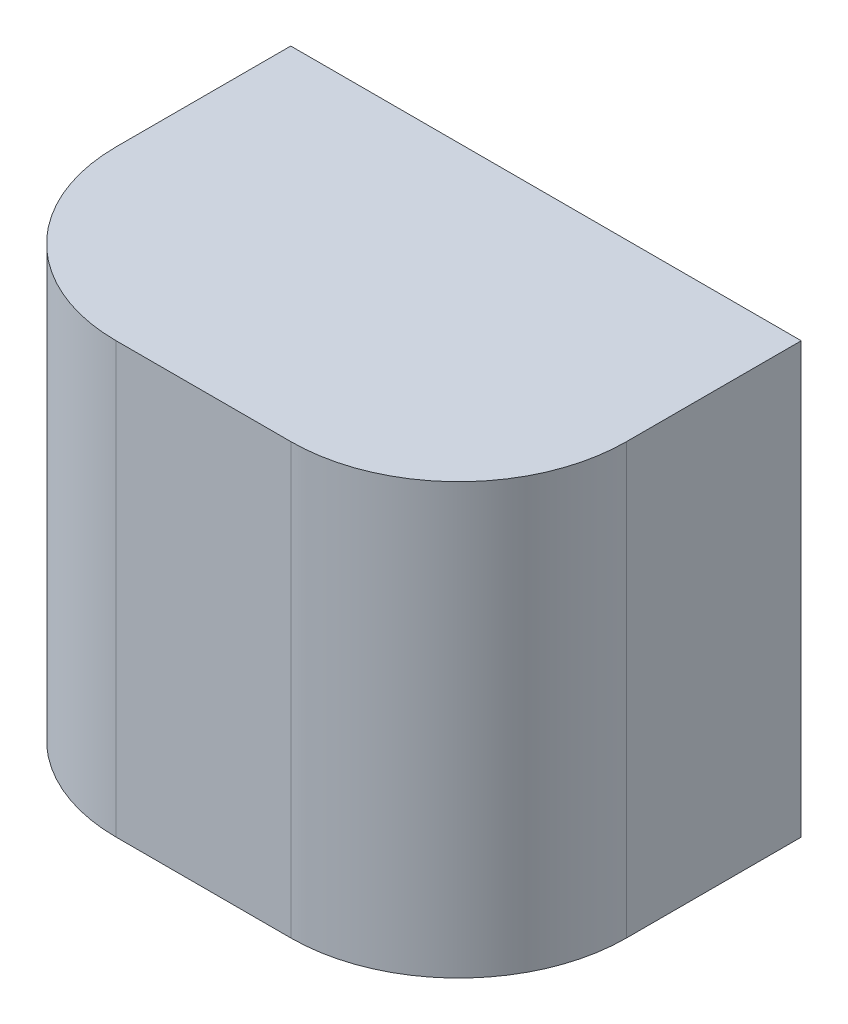
ISO-10303-21;
HEADER;
FILE_DESCRIPTION(('STEP AP214'),'2;1');
FILE_NAME('part.step','',(''),(''),'','','');
FILE_SCHEMA(('AUTOMOTIVE_DESIGN { 1 0 10303 214 1 1 1 1 }'));
ENDSEC;
DATA;
#1=APPLICATION_CONTEXT('core data for automotive mechanical design processes');
#2=APPLICATION_PROTOCOL_DEFINITION('international standard','automotive_design',2000,#1);
#3=PRODUCT_CONTEXT('',#1,'mechanical');
#4=PRODUCT('Part','Part','',(#3));
#5=PRODUCT_RELATED_PRODUCT_CATEGORY('part','',(#4));
#6=PRODUCT_DEFINITION_FORMATION('','',#4);
#7=PRODUCT_DEFINITION_CONTEXT('part definition',#1,'design');
#8=PRODUCT_DEFINITION('design','',#6,#7);
#9=PRODUCT_DEFINITION_SHAPE('','',#8);
#10=(LENGTH_UNIT() NAMED_UNIT(*) SI_UNIT(.MILLI.,.METRE.));
#11=(NAMED_UNIT(*) PLANE_ANGLE_UNIT() SI_UNIT($,.RADIAN.));
#12=(NAMED_UNIT(*) SI_UNIT($,.STERADIAN.) SOLID_ANGLE_UNIT());
#13=UNCERTAINTY_MEASURE_WITH_UNIT(LENGTH_MEASURE(1.E-05),#10,'distance_accuracy_value','');
#14=(GEOMETRIC_REPRESENTATION_CONTEXT(3) GLOBAL_UNCERTAINTY_ASSIGNED_CONTEXT((#13)) GLOBAL_UNIT_ASSIGNED_CONTEXT((#10,
#11,#12)) REPRESENTATION_CONTEXT('',''));
#15=CARTESIAN_POINT('',(0.,0.,0.));
#16=DIRECTION('',(0.,0.,1.));
#17=DIRECTION('',(1.,0.,0.));
#18=AXIS2_PLACEMENT_3D('',#15,#16,#17);
#19=CARTESIAN_POINT('',(1.4,0.,1.655));
#20=DIRECTION('',(0.,-1.,0.));
#21=DIRECTION('',(0.,0.,-1.));
#22=AXIS2_PLACEMENT_3D('',#19,#20,#21);
#23=CYLINDRICAL_SURFACE('',#22,0.25);
#24=CARTESIAN_POINT('',(1.4,-0.64,1.655));
#25=DIRECTION('',(0.,-1.,0.));
#26=DIRECTION('',(0.,0.,-1.));
#27=AXIS2_PLACEMENT_3D('',#24,#25,#26);
#28=CIRCLE('',#27,0.25);
#29=CARTESIAN_POINT('',(1.65,-0.64,1.655));
#30=VERTEX_POINT('',#29);
#31=CARTESIAN_POINT('',(1.4,-0.64,1.905));
#32=VERTEX_POINT('',#31);
#33=EDGE_CURVE('E11',#30,#32,#28,.T.);
#34=ORIENTED_EDGE('',*,*,#33,.F.);
#35=DIRECTION('',(0.,-1.,0.));
#36=VECTOR('',#35,1.);
#37=CARTESIAN_POINT('',(1.65,0.,1.655));
#38=LINE('',#37,#36);
#39=CARTESIAN_POINT('',(1.65,0.,1.655));
#40=VERTEX_POINT('',#39);
#41=EDGE_CURVE('E24',#40,#30,#38,.T.);
#42=ORIENTED_EDGE('',*,*,#41,.F.);
#43=CARTESIAN_POINT('',(1.4,0.,1.655));
#44=DIRECTION('',(0.,-1.,0.));
#45=DIRECTION('',(0.,0.,-1.));
#46=AXIS2_PLACEMENT_3D('',#43,#44,#45);
#47=CIRCLE('',#46,0.25);
#48=CARTESIAN_POINT('',(1.4,0.,1.905));
#49=VERTEX_POINT('',#48);
#50=EDGE_CURVE('E119',#40,#49,#47,.T.);
#51=ORIENTED_EDGE('',*,*,#50,.T.);
#52=DIRECTION('',(0.,-1.,0.));
#53=VECTOR('',#52,1.);
#54=CARTESIAN_POINT('',(1.4,0.,1.905));
#55=LINE('',#54,#53);
#56=EDGE_CURVE('E90',#49,#32,#55,.T.);
#57=ORIENTED_EDGE('',*,*,#56,.T.);
#58=EDGE_LOOP('',(#34,#42,#51,#57));
#59=FACE_BOUND('',#58,.T.);
#60=ADVANCED_FACE('F17',(#59),#23,.T.);
#61=CARTESIAN_POINT('',(1.65,0.,1.395));
#62=DIRECTION('',(1.,0.,0.));
#63=DIRECTION('',(0.,0.,-1.));
#64=AXIS2_PLACEMENT_3D('',#61,#62,#63);
#65=PLANE('',#64);
#66=DIRECTION('',(0.,0.,1.));
#67=VECTOR('',#66,1.);
#68=CARTESIAN_POINT('',(1.65,-0.64,1.395));
#69=LINE('',#68,#67);
#70=CARTESIAN_POINT('',(1.65,-0.64,1.395));
#71=VERTEX_POINT('',#70);
#72=EDGE_CURVE('E116',#71,#30,#69,.T.);
#73=ORIENTED_EDGE('',*,*,#72,.F.);
#74=DIRECTION('',(0.,-1.,0.));
#75=VECTOR('',#74,1.);
#76=CARTESIAN_POINT('',(1.65,0.,1.395));
#77=LINE('',#76,#75);
#78=CARTESIAN_POINT('',(1.65,0.,1.395));
#79=VERTEX_POINT('',#78);
#80=EDGE_CURVE('E113',#79,#71,#77,.T.);
#81=ORIENTED_EDGE('',*,*,#80,.F.);
#82=DIRECTION('',(0.,0.,1.));
#83=VECTOR('',#82,1.);
#84=CARTESIAN_POINT('',(1.65,0.,1.395));
#85=LINE('',#84,#83);
#86=EDGE_CURVE('E110',#79,#40,#85,.T.);
#87=ORIENTED_EDGE('',*,*,#86,.T.);
#88=ORIENTED_EDGE('',*,*,#41,.T.);
#89=EDGE_LOOP('',(#73,#81,#87,#88));
#90=FACE_BOUND('',#89,.T.);
#91=ADVANCED_FACE('F121',(#90),#65,.T.);
#92=CARTESIAN_POINT('',(1.65,0.,1.395));
#93=DIRECTION('',(0.,0.,-1.));
#94=DIRECTION('',(-1.,0.,0.));
#95=AXIS2_PLACEMENT_3D('',#92,#93,#94);
#96=PLANE('',#95);
#97=DIRECTION('',(1.,0.,0.));
#98=VECTOR('',#97,1.);
#99=CARTESIAN_POINT('',(1.65,-0.64,1.395));
#100=LINE('',#99,#98);
#101=CARTESIAN_POINT('',(0.88999999999999,-0.64,1.395));
#102=VERTEX_POINT('',#101);
#103=EDGE_CURVE('E107',#102,#71,#100,.T.);
#104=ORIENTED_EDGE('',*,*,#103,.F.);
#105=DIRECTION('',(0.,-1.,0.));
#106=VECTOR('',#105,1.);
#107=CARTESIAN_POINT('',(0.88999999999999,0.,1.395));
#108=LINE('',#107,#106);
#109=CARTESIAN_POINT('',(0.88999999999999,0.,1.395));
#110=VERTEX_POINT('',#109);
#111=EDGE_CURVE('E104',#110,#102,#108,.T.);
#112=ORIENTED_EDGE('',*,*,#111,.F.);
#113=DIRECTION('',(1.,0.,0.));
#114=VECTOR('',#113,1.);
#115=CARTESIAN_POINT('',(1.65,0.,1.395));
#116=LINE('',#115,#114);
#117=EDGE_CURVE('E101',#110,#79,#116,.T.);
#118=ORIENTED_EDGE('',*,*,#117,.T.);
#119=ORIENTED_EDGE('',*,*,#80,.T.);
#120=EDGE_LOOP('',(#104,#112,#118,#119));
#121=FACE_BOUND('',#120,.T.);
#122=ADVANCED_FACE('F125',(#121),#96,.T.);
#123=CARTESIAN_POINT('',(0.88999999999999,0.,1.395));
#124=DIRECTION('',(-1.,0.,0.));
#125=DIRECTION('',(0.,0.,1.));
#126=AXIS2_PLACEMENT_3D('',#123,#124,#125);
#127=PLANE('',#126);
#128=DIRECTION('',(0.,0.,-1.));
#129=VECTOR('',#128,1.);
#130=CARTESIAN_POINT('',(0.88999999999999,-0.64,1.395));
#131=LINE('',#130,#129);
#132=CARTESIAN_POINT('',(0.89,-0.64,1.655));
#133=VERTEX_POINT('',#132);
#134=EDGE_CURVE('E98',#133,#102,#131,.T.);
#135=ORIENTED_EDGE('',*,*,#134,.F.);
#136=DIRECTION('',(0.,-1.,0.));
#137=VECTOR('',#136,1.);
#138=CARTESIAN_POINT('',(0.89,0.,1.655));
#139=LINE('',#138,#137);
#140=CARTESIAN_POINT('',(0.89,0.,1.655));
#141=VERTEX_POINT('',#140);
#142=EDGE_CURVE('E96',#141,#133,#139,.T.);
#143=ORIENTED_EDGE('',*,*,#142,.F.);
#144=DIRECTION('',(0.,0.,-1.));
#145=VECTOR('',#144,1.);
#146=CARTESIAN_POINT('',(0.88999999999999,0.,1.395));
#147=LINE('',#146,#145);
#148=EDGE_CURVE('E85',#141,#110,#147,.T.);
#149=ORIENTED_EDGE('',*,*,#148,.T.);
#150=ORIENTED_EDGE('',*,*,#111,.T.);
#151=EDGE_LOOP('',(#135,#143,#149,#150));
#152=FACE_BOUND('',#151,.T.);
#153=ADVANCED_FACE('F127',(#152),#127,.T.);
#154=CARTESIAN_POINT('',(1.14,0.,1.655));
#155=DIRECTION('',(0.,-1.,0.));
#156=DIRECTION('',(0.,0.,-1.));
#157=AXIS2_PLACEMENT_3D('',#154,#155,#156);
#158=CYLINDRICAL_SURFACE('',#157,0.25);
#159=CARTESIAN_POINT('',(1.14,-0.64,1.655));
#160=DIRECTION('',(0.,-1.,0.));
#161=DIRECTION('',(0.,0.,-1.));
#162=AXIS2_PLACEMENT_3D('',#159,#160,#161);
#163=CIRCLE('',#162,0.25);
#164=CARTESIAN_POINT('',(1.14,-0.64,1.905));
#165=VERTEX_POINT('',#164);
#166=EDGE_CURVE('E72',#165,#133,#163,.T.);
#167=ORIENTED_EDGE('',*,*,#166,.F.);
#168=DIRECTION('',(0.,-1.,0.));
#169=VECTOR('',#168,1.);
#170=CARTESIAN_POINT('',(1.14,0.,1.905));
#171=LINE('',#170,#169);
#172=CARTESIAN_POINT('',(1.14,0.,1.905));
#173=VERTEX_POINT('',#172);
#174=EDGE_CURVE('E66',#173,#165,#171,.T.);
#175=ORIENTED_EDGE('',*,*,#174,.F.);
#176=CARTESIAN_POINT('',(1.14,0.,1.655));
#177=DIRECTION('',(0.,-1.,0.));
#178=DIRECTION('',(0.,0.,-1.));
#179=AXIS2_PLACEMENT_3D('',#176,#177,#178);
#180=CIRCLE('',#179,0.25);
#181=EDGE_CURVE('E70',#173,#141,#180,.T.);
#182=ORIENTED_EDGE('',*,*,#181,.T.);
#183=ORIENTED_EDGE('',*,*,#142,.T.);
#184=EDGE_LOOP('',(#167,#175,#182,#183));
#185=FACE_BOUND('',#184,.T.);
#186=ADVANCED_FACE('F68',(#185),#158,.T.);
#187=CARTESIAN_POINT('',(1.4,0.,1.905));
#188=DIRECTION('',(0.,0.,1.));
#189=DIRECTION('',(1.,0.,0.));
#190=AXIS2_PLACEMENT_3D('',#187,#188,#189);
#191=PLANE('',#190);
#192=DIRECTION('',(-1.,0.,0.));
#193=VECTOR('',#192,1.);
#194=CARTESIAN_POINT('',(1.4,-0.64,1.905));
#195=LINE('',#194,#193);
#196=EDGE_CURVE('E86',#32,#165,#195,.T.);
#197=ORIENTED_EDGE('',*,*,#196,.F.);
#198=ORIENTED_EDGE('',*,*,#56,.F.);
#199=DIRECTION('',(-1.,0.,0.));
#200=VECTOR('',#199,1.);
#201=CARTESIAN_POINT('',(1.4,0.,1.905));
#202=LINE('',#201,#200);
#203=EDGE_CURVE('E82',#49,#173,#202,.T.);
#204=ORIENTED_EDGE('',*,*,#203,.T.);
#205=ORIENTED_EDGE('',*,*,#174,.T.);
#206=EDGE_LOOP('',(#197,#198,#204,#205));
#207=FACE_BOUND('',#206,.T.);
#208=ADVANCED_FACE('F89',(#207),#191,.T.);
#209=CARTESIAN_POINT('',(1.4,0.,1.655));
#210=DIRECTION('',(0.,-1.,0.));
#211=DIRECTION('',(0.,0.,-1.));
#212=AXIS2_PLACEMENT_3D('',#209,#210,#211);
#213=PLANE('',#212);
#214=ORIENTED_EDGE('',*,*,#50,.F.);
#215=ORIENTED_EDGE('',*,*,#86,.F.);
#216=ORIENTED_EDGE('',*,*,#117,.F.);
#217=ORIENTED_EDGE('',*,*,#148,.F.);
#218=ORIENTED_EDGE('',*,*,#181,.F.);
#219=ORIENTED_EDGE('',*,*,#203,.F.);
#220=EDGE_LOOP('',(#214,#215,#216,#217,#218,#219));
#221=FACE_BOUND('',#220,.T.);
#222=ADVANCED_FACE('F81',(#221),#213,.F.);
#223=CARTESIAN_POINT('',(1.4,-0.64,1.655));
#224=DIRECTION('',(0.,-1.,0.));
#225=DIRECTION('',(0.,0.,-1.));
#226=AXIS2_PLACEMENT_3D('',#223,#224,#225);
#227=PLANE('',#226);
#228=ORIENTED_EDGE('',*,*,#33,.T.);
#229=ORIENTED_EDGE('',*,*,#196,.T.);
#230=ORIENTED_EDGE('',*,*,#166,.T.);
#231=ORIENTED_EDGE('',*,*,#134,.T.);
#232=ORIENTED_EDGE('',*,*,#103,.T.);
#233=ORIENTED_EDGE('',*,*,#72,.T.);
#234=EDGE_LOOP('',(#228,#229,#230,#231,#232,#233));
#235=FACE_BOUND('',#234,.T.);
#236=ADVANCED_FACE('F123',(#235),#227,.T.);
#237=CLOSED_SHELL('',(#60,#91,#122,#153,#186,#208,#222,#236));
#238=MANIFOLD_SOLID_BREP('B1',#237);
#239=ADVANCED_BREP_SHAPE_REPRESENTATION('',(#18,#238),#14);
#240=SHAPE_DEFINITION_REPRESENTATION(#9,#239);
ENDSEC;
END-ISO-10303-21;
